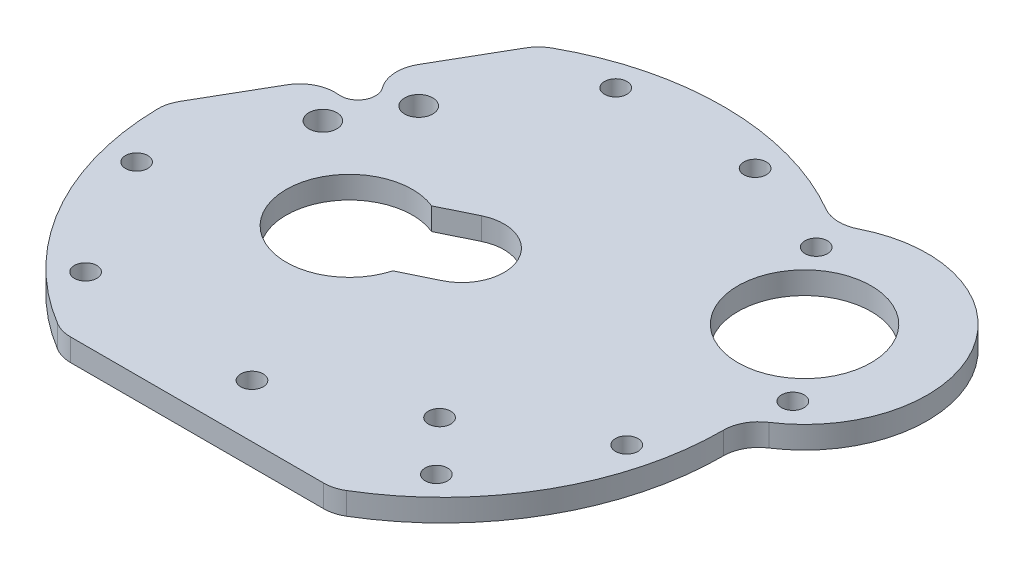
ISO-10303-21;
HEADER;
FILE_DESCRIPTION(('STEP AP214'),'2;1');
FILE_NAME('part.step','',(''),(''),'','','');
FILE_SCHEMA(('AUTOMOTIVE_DESIGN { 1 0 10303 214 1 1 1 1 }'));
ENDSEC;
DATA;
#1=APPLICATION_CONTEXT('core data for automotive mechanical design processes');
#2=APPLICATION_PROTOCOL_DEFINITION('international standard','automotive_design',2000,#1);
#3=PRODUCT_CONTEXT('',#1,'mechanical');
#4=PRODUCT('Part','Part','',(#3));
#5=PRODUCT_RELATED_PRODUCT_CATEGORY('part','',(#4));
#6=PRODUCT_DEFINITION_FORMATION('','',#4);
#7=PRODUCT_DEFINITION_CONTEXT('part definition',#1,'design');
#8=PRODUCT_DEFINITION('design','',#6,#7);
#9=PRODUCT_DEFINITION_SHAPE('','',#8);
#10=(LENGTH_UNIT() NAMED_UNIT(*) SI_UNIT(.MILLI.,.METRE.));
#11=(NAMED_UNIT(*) PLANE_ANGLE_UNIT() SI_UNIT($,.RADIAN.));
#12=(NAMED_UNIT(*) SI_UNIT($,.STERADIAN.) SOLID_ANGLE_UNIT());
#13=UNCERTAINTY_MEASURE_WITH_UNIT(LENGTH_MEASURE(1.E-05),#10,'distance_accuracy_value','');
#14=(GEOMETRIC_REPRESENTATION_CONTEXT(3) GLOBAL_UNCERTAINTY_ASSIGNED_CONTEXT((#13)) GLOBAL_UNIT_ASSIGNED_CONTEXT((#10,
#11,#12)) REPRESENTATION_CONTEXT('',''));
#15=CARTESIAN_POINT('',(0.,0.,0.));
#16=DIRECTION('',(0.,0.,1.));
#17=DIRECTION('',(1.,0.,0.));
#18=AXIS2_PLACEMENT_3D('',#15,#16,#17);
#19=CARTESIAN_POINT('',(-30.3108891324554,3.175,-17.5));
#20=DIRECTION('',(0.866025403784439,0.,0.5));
#21=DIRECTION('',(0.5,0.,-0.866025403784439));
#22=AXIS2_PLACEMENT_3D('',#19,#20,#21);
#23=PLANE('',#22);
#24=DIRECTION('',(-0.5,0.,0.866025403784439));
#25=VECTOR('',#24,1.);
#26=CARTESIAN_POINT('',(-30.3108891324554,3.175,-17.5));
#27=LINE('',#26,#25);
#28=CARTESIAN_POINT('',(-21.2970109437954,3.175,-33.112494995996));
#29=VERTEX_POINT('',#28);
#30=CARTESIAN_POINT('',(-26.8739573612385,3.175,-23.4529404498953));
#31=VERTEX_POINT('',#30);
#32=EDGE_CURVE('E222',#29,#31,#27,.T.);
#33=ORIENTED_EDGE('',*,*,#32,.F.);
#34=DIRECTION('',(0.,-1.,0.));
#35=VECTOR('',#34,1.);
#36=CARTESIAN_POINT('',(-21.2970109437954,3.175,-33.112494995996));
#37=LINE('',#36,#35);
#38=CARTESIAN_POINT('',(-21.2970109437954,0.,-33.112494995996));
#39=VERTEX_POINT('',#38);
#40=EDGE_CURVE('E371',#29,#39,#37,.T.);
#41=ORIENTED_EDGE('',*,*,#40,.T.);
#42=DIRECTION('',(-0.5,0.,0.866025403784439));
#43=VECTOR('',#42,1.);
#44=CARTESIAN_POINT('',(-30.3108891324554,0.,-17.5));
#45=LINE('',#44,#43);
#46=CARTESIAN_POINT('',(-26.8739573612385,0.,-23.4529404498953));
#47=VERTEX_POINT('',#46);
#48=EDGE_CURVE('E291',#39,#47,#45,.T.);
#49=ORIENTED_EDGE('',*,*,#48,.T.);
#50=DIRECTION('',(0.,1.,0.));
#51=VECTOR('',#50,1.);
#52=CARTESIAN_POINT('',(-26.8739573612385,3.175,-23.4529404498953));
#53=LINE('',#52,#51);
#54=EDGE_CURVE('E52',#47,#31,#53,.T.);
#55=ORIENTED_EDGE('',*,*,#54,.T.);
#56=EDGE_LOOP('',(#33,#41,#49,#55));
#57=FACE_BOUND('',#56,.T.);
#58=ADVANCED_FACE('F37',(#57),#23,.F.);
#59=CARTESIAN_POINT('',(32.7031788014801,3.175,-18.8811890843912));
#60=DIRECTION('',(0.,-1.,0.));
#61=DIRECTION('',(0.,0.,-1.));
#62=AXIS2_PLACEMENT_3D('',#59,#60,#61);
#63=CYLINDRICAL_SURFACE('',#62,17.5);
#64=CARTESIAN_POINT('',(32.7031788014801,0.,-18.8811890843912));
#65=DIRECTION('',(0.,1.,0.));
#66=DIRECTION('',(0.,0.,1.));
#67=AXIS2_PLACEMENT_3D('',#64,#65,#66);
#68=CIRCLE('',#67,17.5);
#69=CARTESIAN_POINT('',(42.267360109847,0.,-4.22593624110372));
#70=VERTEX_POINT('',#69);
#71=CARTESIAN_POINT('',(24.7934481944923,0.,-34.4916394854809));
#72=VERTEX_POINT('',#71);
#73=EDGE_CURVE('E282',#70,#72,#68,.T.);
#74=ORIENTED_EDGE('',*,*,#73,.T.);
#75=DIRECTION('',(0.,-1.,0.));
#76=VECTOR('',#75,1.);
#77=CARTESIAN_POINT('',(24.7934481944923,3.175,-34.4916394854809));
#78=LINE('',#77,#76);
#79=CARTESIAN_POINT('',(24.7934481944923,3.175,-34.4916394854809));
#80=VERTEX_POINT('',#79);
#81=EDGE_CURVE('E312',#72,#80,#78,.F.);
#82=ORIENTED_EDGE('',*,*,#81,.T.);
#83=CARTESIAN_POINT('',(32.7031788014801,3.175,-18.8811890843912));
#84=DIRECTION('',(0.,1.,0.));
#85=DIRECTION('',(0.,0.,1.));
#86=AXIS2_PLACEMENT_3D('',#83,#84,#85);
#87=CIRCLE('',#86,17.5);
#88=CARTESIAN_POINT('',(42.267360109847,3.175,-4.22593624110372));
#89=VERTEX_POINT('',#88);
#90=EDGE_CURVE('E215',#89,#80,#87,.T.);
#91=ORIENTED_EDGE('',*,*,#90,.F.);
#92=DIRECTION('',(0.,-1.,0.));
#93=VECTOR('',#92,1.);
#94=CARTESIAN_POINT('',(42.267360109847,3.175,-4.22593624110372));
#95=LINE('',#94,#93);
#96=EDGE_CURVE('E309',#89,#70,#95,.T.);
#97=ORIENTED_EDGE('',*,*,#96,.T.);
#98=EDGE_LOOP('',(#74,#82,#91,#97));
#99=FACE_BOUND('',#98,.T.);
#100=ADVANCED_FACE('F475',(#99),#63,.T.);
#101=CARTESIAN_POINT('',(0.,3.175,0.));
#102=DIRECTION('',(0.,-1.,0.));
#103=DIRECTION('',(0.,0.,-1.));
#104=AXIS2_PLACEMENT_3D('',#101,#102,#103);
#105=CYLINDRICAL_SURFACE('',#104,40.);
#106=CARTESIAN_POINT('',(0.,0.,0.));
#107=DIRECTION('',(0.,1.,0.));
#108=DIRECTION('',(0.,0.,1.));
#109=AXIS2_PLACEMENT_3D('',#106,#107,#108);
#110=CIRCLE('',#109,40.);
#111=CARTESIAN_POINT('',(20.0298001457105,0.,-34.623793930228));
#112=VERTEX_POINT('',#111);
#113=CARTESIAN_POINT('',(-19.3907244855694,0.,-34.9857085668525));
#114=VERTEX_POINT('',#113);
#115=EDGE_CURVE('E285',#112,#114,#110,.T.);
#116=ORIENTED_EDGE('',*,*,#115,.T.);
#117=DIRECTION('',(0.,-1.,0.));
#118=VECTOR('',#117,1.);
#119=CARTESIAN_POINT('',(-19.3907244855694,3.175,-34.9857085668525));
#120=LINE('',#119,#118);
#121=CARTESIAN_POINT('',(-19.3907244855694,3.175,-34.9857085668525));
#122=VERTEX_POINT('',#121);
#123=EDGE_CURVE('E374',#114,#122,#120,.F.);
#124=ORIENTED_EDGE('',*,*,#123,.T.);
#125=CARTESIAN_POINT('',(0.,3.175,0.));
#126=DIRECTION('',(0.,1.,0.));
#127=DIRECTION('',(0.,0.,1.));
#128=AXIS2_PLACEMENT_3D('',#125,#126,#127);
#129=CIRCLE('',#128,40.);
#130=CARTESIAN_POINT('',(20.0298001457105,3.175,-34.623793930228));
#131=VERTEX_POINT('',#130);
#132=EDGE_CURVE('E219',#131,#122,#129,.T.);
#133=ORIENTED_EDGE('',*,*,#132,.F.);
#134=DIRECTION('',(0.,-1.,0.));
#135=VECTOR('',#134,1.);
#136=CARTESIAN_POINT('',(20.0298001457105,3.175,-34.623793930228));
#137=LINE('',#136,#135);
#138=EDGE_CURVE('E187',#131,#112,#137,.T.);
#139=ORIENTED_EDGE('',*,*,#138,.T.);
#140=EDGE_LOOP('',(#116,#124,#133,#139));
#141=FACE_BOUND('',#140,.T.);
#142=ADVANCED_FACE('F481',(#141),#105,.T.);
#143=CARTESIAN_POINT('',(-33.7478209036722,0.,-11.5470595501047));
#144=VERTEX_POINT('',#143);
#145=CARTESIAN_POINT('',(-39.3247673211153,0.,-1.88750500400403));
#146=VERTEX_POINT('',#145);
#147=EDGE_CURVE('E288',#144,#146,#45,.T.);
#148=ORIENTED_EDGE('',*,*,#147,.T.);
#149=DIRECTION('',(0.,-1.,0.));
#150=VECTOR('',#149,1.);
#151=CARTESIAN_POINT('',(-39.3247673211153,3.175,-1.88750500400403));
#152=LINE('',#151,#150);
#153=CARTESIAN_POINT('',(-39.3247673211153,3.175,-1.88750500400403));
#154=VERTEX_POINT('',#153);
#155=EDGE_CURVE('E368',#146,#154,#152,.F.);
#156=ORIENTED_EDGE('',*,*,#155,.T.);
#157=CARTESIAN_POINT('',(-33.7478209036722,3.175,-11.5470595501047));
#158=VERTEX_POINT('',#157);
#159=EDGE_CURVE('E221',#158,#154,#27,.T.);
#160=ORIENTED_EDGE('',*,*,#159,.F.);
#161=DIRECTION('',(0.,1.,0.));
#162=VECTOR('',#161,1.);
#163=CARTESIAN_POINT('',(-33.7478209036722,3.175,-11.5470595501047));
#164=LINE('',#163,#162);
#165=EDGE_CURVE('E366',#158,#144,#164,.F.);
#166=ORIENTED_EDGE('',*,*,#165,.T.);
#167=EDGE_LOOP('',(#148,#156,#160,#166));
#168=FACE_BOUND('',#167,.T.);
#169=ADVANCED_FACE('F477',(#168),#23,.F.);
#170=CARTESIAN_POINT('',(0.,3.175,0.));
#171=DIRECTION('',(0.,-1.,0.));
#172=DIRECTION('',(0.,0.,-1.));
#173=AXIS2_PLACEMENT_3D('',#170,#171,#172);
#174=CYLINDRICAL_SURFACE('',#173,40.);
#175=CARTESIAN_POINT('',(0.,0.,0.));
#176=DIRECTION('',(0.,1.,0.));
#177=DIRECTION('',(0.,0.,1.));
#178=AXIS2_PLACEMENT_3D('',#175,#176,#177);
#179=CIRCLE('',#178,40.);
#180=CARTESIAN_POINT('',(-39.9938746310779,0.,0.699994281138249));
#181=VERTEX_POINT('',#180);
#182=CARTESIAN_POINT('',(-20.6031501455085,0.,34.2857142857143));
#183=VERTEX_POINT('',#182);
#184=EDGE_CURVE('E292',#181,#183,#179,.T.);
#185=ORIENTED_EDGE('',*,*,#184,.T.);
#186=DIRECTION('',(0.,-1.,0.));
#187=VECTOR('',#186,1.);
#188=CARTESIAN_POINT('',(-20.6031501455085,3.175,34.2857142857143));
#189=LINE('',#188,#187);
#190=CARTESIAN_POINT('',(-20.6031501455085,3.175,34.2857142857143));
#191=VERTEX_POINT('',#190);
#192=EDGE_CURVE('E364',#183,#191,#189,.F.);
#193=ORIENTED_EDGE('',*,*,#192,.T.);
#194=CARTESIAN_POINT('',(0.,3.175,0.));
#195=DIRECTION('',(0.,1.,0.));
#196=DIRECTION('',(0.,0.,1.));
#197=AXIS2_PLACEMENT_3D('',#194,#195,#196);
#198=CIRCLE('',#197,40.);
#199=CARTESIAN_POINT('',(-39.9938746310779,3.175,0.699994281138249));
#200=VERTEX_POINT('',#199);
#201=EDGE_CURVE('E224',#200,#191,#198,.T.);
#202=ORIENTED_EDGE('',*,*,#201,.F.);
#203=DIRECTION('',(0.,-1.,0.));
#204=VECTOR('',#203,1.);
#205=CARTESIAN_POINT('',(-39.9938746310778,3.175,0.699994281138249));
#206=LINE('',#205,#204);
#207=EDGE_CURVE('E361',#200,#181,#206,.T.);
#208=ORIENTED_EDGE('',*,*,#207,.T.);
#209=EDGE_LOOP('',(#185,#193,#202,#208));
#210=FACE_BOUND('',#209,.T.);
#211=ADVANCED_FACE('F487',(#210),#174,.T.);
#212=CARTESIAN_POINT('',(0.,3.175,35.));
#213=DIRECTION('',(0.,0.,-1.));
#214=DIRECTION('',(-1.,0.,0.));
#215=AXIS2_PLACEMENT_3D('',#212,#213,#214);
#216=PLANE('',#215);
#217=DIRECTION('',(1.,0.,0.));
#218=VECTOR('',#217,1.);
#219=CARTESIAN_POINT('',(0.,0.,35.));
#220=LINE('',#219,#218);
#221=CARTESIAN_POINT('',(-18.0277563773199,0.,35.));
#222=VERTEX_POINT('',#221);
#223=CARTESIAN_POINT('',(18.0277563773199,0.,35.));
#224=VERTEX_POINT('',#223);
#225=EDGE_CURVE('E295',#222,#224,#220,.T.);
#226=ORIENTED_EDGE('',*,*,#225,.T.);
#227=DIRECTION('',(0.,-1.,0.));
#228=VECTOR('',#227,1.);
#229=CARTESIAN_POINT('',(18.0277563773199,3.175,35.));
#230=LINE('',#229,#228);
#231=CARTESIAN_POINT('',(18.0277563773199,3.175,35.));
#232=VERTEX_POINT('',#231);
#233=EDGE_CURVE('E348',#224,#232,#230,.F.);
#234=ORIENTED_EDGE('',*,*,#233,.T.);
#235=DIRECTION('',(1.,0.,0.));
#236=VECTOR('',#235,1.);
#237=CARTESIAN_POINT('',(0.,3.175,35.));
#238=LINE('',#237,#236);
#239=CARTESIAN_POINT('',(-18.0277563773199,3.175,35.));
#240=VERTEX_POINT('',#239);
#241=EDGE_CURVE('E227',#240,#232,#238,.T.);
#242=ORIENTED_EDGE('',*,*,#241,.F.);
#243=DIRECTION('',(0.,-1.,0.));
#244=VECTOR('',#243,1.);
#245=CARTESIAN_POINT('',(-18.0277563773199,3.175,35.));
#246=LINE('',#245,#244);
#247=EDGE_CURVE('E345',#240,#222,#246,.T.);
#248=ORIENTED_EDGE('',*,*,#247,.T.);
#249=EDGE_LOOP('',(#226,#234,#242,#248));
#250=FACE_BOUND('',#249,.T.);
#251=ADVANCED_FACE('F493',(#250),#216,.F.);
#252=CARTESIAN_POINT('',(-1.1036926971255,3.175,-3.84471877129028));
#253=DIRECTION('',(0.,-1.,0.));
#254=DIRECTION('',(0.,0.,-1.));
#255=AXIS2_PLACEMENT_3D('',#252,#253,#254);
#256=CYLINDRICAL_SURFACE('',#255,5.99999999999999);
#257=CARTESIAN_POINT('',(-1.1036926971255,0.,-3.84471877129028));
#258=DIRECTION('',(0.,1.,0.));
#259=DIRECTION('',(0.,0.,1.));
#260=AXIS2_PLACEMENT_3D('',#257,#258,#259);
#261=CIRCLE('',#260,5.99999999999999);
#262=CARTESIAN_POINT('',(1.52653418360897,0.,1.54804550650471));
#263=VERTEX_POINT('',#262);
#264=CARTESIAN_POINT('',(-3.73391957785997,0.,-9.23748304908527));
#265=VERTEX_POINT('',#264);
#266=EDGE_CURVE('E183',#263,#265,#261,.T.);
#267=ORIENTED_EDGE('',*,*,#266,.F.);
#268=DIRECTION('',(0.,-1.,0.));
#269=VECTOR('',#268,1.);
#270=CARTESIAN_POINT('',(1.52653418360897,3.175,1.54804550650471));
#271=LINE('',#270,#269);
#272=CARTESIAN_POINT('',(1.52653418360897,3.175,1.54804550650471));
#273=VERTEX_POINT('',#272);
#274=EDGE_CURVE('E176',#273,#263,#271,.T.);
#275=ORIENTED_EDGE('',*,*,#274,.F.);
#276=CARTESIAN_POINT('',(-1.1036926971255,3.175,-3.84471877129028));
#277=DIRECTION('',(0.,1.,0.));
#278=DIRECTION('',(0.,0.,1.));
#279=AXIS2_PLACEMENT_3D('',#276,#277,#278);
#280=CIRCLE('',#279,5.99999999999999);
#281=CARTESIAN_POINT('',(-3.73391957785997,3.175,-9.23748304908527));
#282=VERTEX_POINT('',#281);
#283=EDGE_CURVE('E180',#273,#282,#280,.T.);
#284=ORIENTED_EDGE('',*,*,#283,.T.);
#285=DIRECTION('',(0.,-1.,0.));
#286=VECTOR('',#285,1.);
#287=CARTESIAN_POINT('',(-3.73391957785997,3.175,-9.23748304908527));
#288=LINE('',#287,#286);
#289=EDGE_CURVE('E232',#282,#265,#288,.T.);
#290=ORIENTED_EDGE('',*,*,#289,.T.);
#291=EDGE_LOOP('',(#267,#275,#284,#290));
#292=FACE_BOUND('',#291,.T.);
#293=ADVANCED_FACE('F178',(#292),#256,.F.);
#294=CARTESIAN_POINT('',(0.903291201095751,3.175,1.85202141967139));
#295=DIRECTION('',(0.438371146789079,0.,0.898794046299166));
#296=DIRECTION('',(0.898794046299166,0.,-0.438371146789079));
#297=AXIS2_PLACEMENT_3D('',#294,#295,#296);
#298=PLANE('',#297);
#299=DIRECTION('',(-0.898794046299166,0.,0.438371146789079));
#300=VECTOR('',#299,1.);
#301=CARTESIAN_POINT('',(0.903291201095751,0.,1.85202141967139));
#302=LINE('',#301,#300);
#303=CARTESIAN_POINT('',(-3.22970061608986,0.,3.86781621718886));
#304=VERTEX_POINT('',#303);
#305=EDGE_CURVE('E273',#263,#304,#302,.T.);
#306=ORIENTED_EDGE('',*,*,#305,.T.);
#307=DIRECTION('',(0.,-1.,0.));
#308=VECTOR('',#307,1.);
#309=CARTESIAN_POINT('',(-3.22970061608986,3.175,3.86781621718886));
#310=LINE('',#309,#308);
#311=CARTESIAN_POINT('',(-3.22970061608986,3.175,3.86781621718886));
#312=VERTEX_POINT('',#311);
#313=EDGE_CURVE('E188',#312,#304,#310,.T.);
#314=ORIENTED_EDGE('',*,*,#313,.F.);
#315=DIRECTION('',(-0.898794046299166,0.,0.438371146789079));
#316=VECTOR('',#315,1.);
#317=CARTESIAN_POINT('',(0.903291201095751,3.175,1.85202141967139));
#318=LINE('',#317,#316);
#319=EDGE_CURVE('E191',#273,#312,#318,.T.);
#320=ORIENTED_EDGE('',*,*,#319,.F.);
#321=ORIENTED_EDGE('',*,*,#274,.T.);
#322=EDGE_LOOP('',(#306,#314,#320,#321));
#323=FACE_BOUND('',#322,.T.);
#324=ADVANCED_FACE('F192',(#323),#298,.F.);
#325=CARTESIAN_POINT('',(-11.8892212527155,3.175,1.41573499017866));
#326=DIRECTION('',(0.,-1.,0.));
#327=DIRECTION('',(0.,0.,-1.));
#328=AXIS2_PLACEMENT_3D('',#325,#326,#327);
#329=CYLINDRICAL_SURFACE('',#328,9.00000000000007);
#330=CARTESIAN_POINT('',(-11.8892212527155,0.,1.41573499017866));
#331=DIRECTION('',(0.,1.,0.));
#332=DIRECTION('',(0.,0.,1.));
#333=AXIS2_PLACEMENT_3D('',#330,#331,#332);
#334=CIRCLE('',#333,9.00000000000007);
#335=CARTESIAN_POINT('',(-8.49015437755879,0.,-6.91771233840112));
#336=VERTEX_POINT('',#335);
#337=EDGE_CURVE('E276',#336,#304,#334,.T.);
#338=ORIENTED_EDGE('',*,*,#337,.F.);
#339=DIRECTION('',(0.,-1.,0.));
#340=VECTOR('',#339,1.);
#341=CARTESIAN_POINT('',(-8.49015437755879,3.175,-6.91771233840112));
#342=LINE('',#341,#340);
#343=CARTESIAN_POINT('',(-8.49015437755879,3.175,-6.91771233840112));
#344=VERTEX_POINT('',#343);
#345=EDGE_CURVE('E304',#344,#336,#342,.T.);
#346=ORIENTED_EDGE('',*,*,#345,.F.);
#347=CARTESIAN_POINT('',(-11.8892212527155,3.175,1.41573499017866));
#348=DIRECTION('',(0.,1.,0.));
#349=DIRECTION('',(0.,0.,1.));
#350=AXIS2_PLACEMENT_3D('',#347,#348,#349);
#351=CIRCLE('',#350,9.00000000000007);
#352=EDGE_CURVE('E196',#344,#312,#351,.T.);
#353=ORIENTED_EDGE('',*,*,#352,.T.);
#354=ORIENTED_EDGE('',*,*,#313,.T.);
#355=EDGE_LOOP('',(#338,#346,#353,#354));
#356=FACE_BOUND('',#355,.T.);
#357=ADVANCED_FACE('F465',(#356),#329,.F.);
#358=CARTESIAN_POINT('',(-4.35716256037318,3.175,-8.93350713591859));
#359=DIRECTION('',(0.438371146789078,0.,0.898794046299167));
#360=DIRECTION('',(0.898794046299167,0.,-0.438371146789078));
#361=AXIS2_PLACEMENT_3D('',#358,#359,#360);
#362=PLANE('',#361);
#363=DIRECTION('',(-0.898794046299167,0.,0.438371146789078));
#364=VECTOR('',#363,1.);
#365=CARTESIAN_POINT('',(-4.35716256037318,0.,-8.93350713591859));
#366=LINE('',#365,#364);
#367=EDGE_CURVE('E279',#265,#336,#366,.T.);
#368=ORIENTED_EDGE('',*,*,#367,.F.);
#369=ORIENTED_EDGE('',*,*,#289,.F.);
#370=DIRECTION('',(-0.898794046299167,0.,0.438371146789078));
#371=VECTOR('',#370,1.);
#372=CARTESIAN_POINT('',(-4.35716256037318,3.175,-8.93350713591859));
#373=LINE('',#372,#371);
#374=EDGE_CURVE('E200',#282,#344,#373,.T.);
#375=ORIENTED_EDGE('',*,*,#374,.T.);
#376=ORIENTED_EDGE('',*,*,#345,.T.);
#377=EDGE_LOOP('',(#368,#369,#375,#376));
#378=FACE_BOUND('',#377,.T.);
#379=ADVANCED_FACE('F452',(#378),#362,.T.);
#380=CARTESIAN_POINT('',(-34.9332342741632,3.175,8.69880124766783));
#381=DIRECTION('',(0.,-1.,0.));
#382=DIRECTION('',(0.,0.,-1.));
#383=AXIS2_PLACEMENT_3D('',#380,#381,#382);
#384=CYLINDRICAL_SURFACE('',#383,1.599999999409);
#385=CARTESIAN_POINT('',(-34.9332342741632,3.175,8.69880124766783));
#386=DIRECTION('',(0.,1.,0.));
#387=DIRECTION('',(0.,0.,1.));
#388=AXIS2_PLACEMENT_3D('',#385,#386,#387);
#389=CIRCLE('',#388,1.599999999409);
#390=CARTESIAN_POINT('',(-34.9332342741632,3.175,10.2988012470768));
#391=VERTEX_POINT('',#390);
#392=EDGE_CURVE('E202',#391,#391,#389,.T.);
#393=ORIENTED_EDGE('',*,*,#392,.T.);
#394=EDGE_LOOP('',(#393));
#395=FACE_BOUND('',#394,.T.);
#396=CARTESIAN_POINT('',(-34.9332342741632,0.,8.69880124766783));
#397=DIRECTION('',(0.,1.,0.));
#398=DIRECTION('',(0.,0.,1.));
#399=AXIS2_PLACEMENT_3D('',#396,#397,#398);
#400=CIRCLE('',#399,1.599999999409);
#401=CARTESIAN_POINT('',(-34.9332342741632,0.,10.2988012470768));
#402=VERTEX_POINT('',#401);
#403=EDGE_CURVE('E269',#402,#402,#400,.T.);
#404=ORIENTED_EDGE('',*,*,#403,.F.);
#405=EDGE_LOOP('',(#404));
#406=FACE_BOUND('',#405,.T.);
#407=ADVANCED_FACE('F449',(#395,#406),#384,.F.);
#408=CARTESIAN_POINT('',(25.0000000000337,3.175,25.9036676939446));
#409=DIRECTION('',(0.,-1.,0.));
#410=DIRECTION('',(0.,0.,-1.));
#411=AXIS2_PLACEMENT_3D('',#408,#409,#410);
#412=CYLINDRICAL_SURFACE('',#411,1.599999999409);
#413=CARTESIAN_POINT('',(25.0000000000337,3.175,25.9036676939446));
#414=DIRECTION('',(0.,1.,0.));
#415=DIRECTION('',(0.,0.,1.));
#416=AXIS2_PLACEMENT_3D('',#413,#414,#415);
#417=CIRCLE('',#416,1.599999999409);
#418=CARTESIAN_POINT('',(25.0000000000337,3.175,27.5036676933536));
#419=VERTEX_POINT('',#418);
#420=EDGE_CURVE('E208',#419,#419,#417,.T.);
#421=ORIENTED_EDGE('',*,*,#420,.T.);
#422=EDGE_LOOP('',(#421));
#423=FACE_BOUND('',#422,.T.);
#424=CARTESIAN_POINT('',(25.0000000000337,0.,25.9036676939446));
#425=DIRECTION('',(0.,1.,0.));
#426=DIRECTION('',(0.,0.,1.));
#427=AXIS2_PLACEMENT_3D('',#424,#425,#426);
#428=CIRCLE('',#427,1.599999999409);
#429=CARTESIAN_POINT('',(25.0000000000337,0.,27.5036676933536));
#430=VERTEX_POINT('',#429);
#431=EDGE_CURVE('E266',#430,#430,#428,.T.);
#432=ORIENTED_EDGE('',*,*,#431,.F.);
#433=EDGE_LOOP('',(#432));
#434=FACE_BOUND('',#433,.T.);
#435=ADVANCED_FACE('F440',(#423,#434),#412,.F.);
#436=CARTESIAN_POINT('',(0.24263363698146,3.175,27.4303096923593));
#437=DIRECTION('',(0.,-1.,0.));
#438=DIRECTION('',(0.,0.,-1.));
#439=AXIS2_PLACEMENT_3D('',#436,#437,#438);
#440=CYLINDRICAL_SURFACE('',#439,1.599999999409);
#441=CARTESIAN_POINT('',(0.24263363698146,3.175,27.4303096923593));
#442=DIRECTION('',(0.,1.,0.));
#443=DIRECTION('',(0.,0.,1.));
#444=AXIS2_PLACEMENT_3D('',#441,#442,#443);
#445=CIRCLE('',#444,1.599999999409);
#446=CARTESIAN_POINT('',(0.24263363698146,3.175,29.0303096917683));
#447=VERTEX_POINT('',#446);
#448=EDGE_CURVE('E434',#447,#447,#445,.T.);
#449=ORIENTED_EDGE('',*,*,#448,.T.);
#450=EDGE_LOOP('',(#449));
#451=FACE_BOUND('',#450,.T.);
#452=CARTESIAN_POINT('',(0.24263363698146,0.,27.4303096923593));
#453=DIRECTION('',(0.,1.,0.));
#454=DIRECTION('',(0.,0.,1.));
#455=AXIS2_PLACEMENT_3D('',#452,#453,#454);
#456=CIRCLE('',#455,1.599999999409);
#457=CARTESIAN_POINT('',(0.24263363698146,0.,29.0303096917683));
#458=VERTEX_POINT('',#457);
#459=EDGE_CURVE('E263',#458,#458,#456,.T.);
#460=ORIENTED_EDGE('',*,*,#459,.F.);
#461=EDGE_LOOP('',(#460));
#462=FACE_BOUND('',#461,.T.);
#463=ADVANCED_FACE('F592',(#451,#462),#440,.F.);
#464=CARTESIAN_POINT('',(-25.0000000000337,3.175,25.9036676939447));
#465=DIRECTION('',(0.,-1.,0.));
#466=DIRECTION('',(0.,0.,-1.));
#467=AXIS2_PLACEMENT_3D('',#464,#465,#466);
#468=CYLINDRICAL_SURFACE('',#467,1.599999999409);
#469=CARTESIAN_POINT('',(-25.0000000000337,3.175,25.9036676939447));
#470=DIRECTION('',(0.,1.,0.));
#471=DIRECTION('',(0.,0.,1.));
#472=AXIS2_PLACEMENT_3D('',#469,#470,#471);
#473=CIRCLE('',#472,1.599999999409);
#474=CARTESIAN_POINT('',(-25.0000000000337,3.175,27.5036676933537));
#475=VERTEX_POINT('',#474);
#476=EDGE_CURVE('E431',#475,#475,#473,.T.);
#477=ORIENTED_EDGE('',*,*,#476,.T.);
#478=EDGE_LOOP('',(#477));
#479=FACE_BOUND('',#478,.T.);
#480=CARTESIAN_POINT('',(-25.0000000000337,0.,25.9036676939447));
#481=DIRECTION('',(0.,1.,0.));
#482=DIRECTION('',(0.,0.,1.));
#483=AXIS2_PLACEMENT_3D('',#480,#481,#482);
#484=CIRCLE('',#483,1.599999999409);
#485=CARTESIAN_POINT('',(-25.0000000000337,0.,27.5036676933537));
#486=VERTEX_POINT('',#485);
#487=EDGE_CURVE('E260',#486,#486,#484,.T.);
#488=ORIENTED_EDGE('',*,*,#487,.F.);
#489=EDGE_LOOP('',(#488));
#490=FACE_BOUND('',#489,.T.);
#491=ADVANCED_FACE('F588',(#479,#490),#468,.F.);
#492=CARTESIAN_POINT('',(18.2185145629648,3.175,18.6628867565777));
#493=DIRECTION('',(0.,-1.,0.));
#494=DIRECTION('',(0.,0.,-1.));
#495=AXIS2_PLACEMENT_3D('',#492,#493,#494);
#496=CYLINDRICAL_SURFACE('',#495,1.599999999409);
#497=CARTESIAN_POINT('',(18.2185145629648,3.175,18.6628867565777));
#498=DIRECTION('',(0.,1.,0.));
#499=DIRECTION('',(0.,0.,1.));
#500=AXIS2_PLACEMENT_3D('',#497,#498,#499);
#501=CIRCLE('',#500,1.599999999409);
#502=CARTESIAN_POINT('',(18.2185145629648,3.175,20.2628867559867));
#503=VERTEX_POINT('',#502);
#504=EDGE_CURVE('E428',#503,#503,#501,.T.);
#505=ORIENTED_EDGE('',*,*,#504,.T.);
#506=EDGE_LOOP('',(#505));
#507=FACE_BOUND('',#506,.T.);
#508=CARTESIAN_POINT('',(18.2185145629648,0.,18.6628867565777));
#509=DIRECTION('',(0.,1.,0.));
#510=DIRECTION('',(0.,0.,1.));
#511=AXIS2_PLACEMENT_3D('',#508,#509,#510);
#512=CIRCLE('',#511,1.599999999409);
#513=CARTESIAN_POINT('',(18.2185145629648,0.,20.2628867559867));
#514=VERTEX_POINT('',#513);
#515=EDGE_CURVE('E256',#514,#514,#512,.T.);
#516=ORIENTED_EDGE('',*,*,#515,.F.);
#517=EDGE_LOOP('',(#516));
#518=FACE_BOUND('',#517,.T.);
#519=ADVANCED_FACE('F584',(#507,#518),#496,.F.);
#520=CARTESIAN_POINT('',(9.93323427412944,3.175,-34.6024689416125));
#521=DIRECTION('',(0.,-1.,0.));
#522=DIRECTION('',(0.,0.,-1.));
#523=AXIS2_PLACEMENT_3D('',#520,#521,#522);
#524=CYLINDRICAL_SURFACE('',#523,1.599999999409);
#525=CARTESIAN_POINT('',(9.93323427412944,3.175,-34.6024689416125));
#526=DIRECTION('',(0.,1.,0.));
#527=DIRECTION('',(0.,0.,1.));
#528=AXIS2_PLACEMENT_3D('',#525,#526,#527);
#529=CIRCLE('',#528,1.599999999409);
#530=CARTESIAN_POINT('',(9.93323427412944,3.175,-33.0024689422035));
#531=VERTEX_POINT('',#530);
#532=EDGE_CURVE('E425',#531,#531,#529,.T.);
#533=ORIENTED_EDGE('',*,*,#532,.T.);
#534=EDGE_LOOP('',(#533));
#535=FACE_BOUND('',#534,.T.);
#536=CARTESIAN_POINT('',(9.93323427412944,0.,-34.6024689416125));
#537=DIRECTION('',(0.,1.,0.));
#538=DIRECTION('',(0.,0.,1.));
#539=AXIS2_PLACEMENT_3D('',#536,#537,#538);
#540=CIRCLE('',#539,1.599999999409);
#541=CARTESIAN_POINT('',(9.93323427412944,0.,-33.0024689422035));
#542=VERTEX_POINT('',#541);
#543=EDGE_CURVE('E253',#542,#542,#540,.T.);
#544=ORIENTED_EDGE('',*,*,#543,.F.);
#545=EDGE_LOOP('',(#544));
#546=FACE_BOUND('',#545,.T.);
#547=ADVANCED_FACE('F580',(#535,#546),#524,.F.);
#548=CARTESIAN_POINT('',(41.3808115322484,3.175,-8.53958910228498));
#549=DIRECTION('',(0.,-1.,0.));
#550=DIRECTION('',(0.,0.,-1.));
#551=AXIS2_PLACEMENT_3D('',#548,#549,#550);
#552=CYLINDRICAL_SURFACE('',#551,1.599999999409);
#553=CARTESIAN_POINT('',(41.3808115322484,3.175,-8.53958910228498));
#554=DIRECTION('',(0.,1.,0.));
#555=DIRECTION('',(0.,0.,1.));
#556=AXIS2_PLACEMENT_3D('',#553,#554,#555);
#557=CIRCLE('',#556,1.599999999409);
#558=CARTESIAN_POINT('',(41.3808115322484,3.175,-6.93958910287598));
#559=VERTEX_POINT('',#558);
#560=EDGE_CURVE('E421',#559,#559,#557,.T.);
#561=ORIENTED_EDGE('',*,*,#560,.T.);
#562=EDGE_LOOP('',(#561));
#563=FACE_BOUND('',#562,.T.);
#564=CARTESIAN_POINT('',(41.3808115322484,0.,-8.53958910228498));
#565=DIRECTION('',(0.,1.,0.));
#566=DIRECTION('',(0.,0.,1.));
#567=AXIS2_PLACEMENT_3D('',#564,#565,#566);
#568=CIRCLE('',#567,1.599999999409);
#569=CARTESIAN_POINT('',(41.3808115322484,0.,-6.93958910287598));
#570=VERTEX_POINT('',#569);
#571=EDGE_CURVE('E249',#570,#570,#568,.T.);
#572=ORIENTED_EDGE('',*,*,#571,.F.);
#573=EDGE_LOOP('',(#572));
#574=FACE_BOUND('',#573,.T.);
#575=ADVANCED_FACE('F576',(#563,#574),#552,.F.);
#576=CARTESIAN_POINT('',(24.0255460707119,3.175,-29.2227890664975));
#577=DIRECTION('',(0.,-1.,0.));
#578=DIRECTION('',(0.,0.,-1.));
#579=AXIS2_PLACEMENT_3D('',#576,#577,#578);
#580=CYLINDRICAL_SURFACE('',#579,1.599999999409);
#581=CARTESIAN_POINT('',(24.0255460707119,3.175,-29.2227890664975));
#582=DIRECTION('',(0.,1.,0.));
#583=DIRECTION('',(0.,0.,1.));
#584=AXIS2_PLACEMENT_3D('',#581,#582,#583);
#585=CIRCLE('',#584,1.599999999409);
#586=CARTESIAN_POINT('',(24.0255460707119,3.175,-27.6227890670885));
#587=VERTEX_POINT('',#586);
#588=EDGE_CURVE('E417',#587,#587,#585,.T.);
#589=ORIENTED_EDGE('',*,*,#588,.T.);
#590=EDGE_LOOP('',(#589));
#591=FACE_BOUND('',#590,.T.);
#592=CARTESIAN_POINT('',(24.0255460707119,0.,-29.2227890664975));
#593=DIRECTION('',(0.,1.,0.));
#594=DIRECTION('',(0.,0.,1.));
#595=AXIS2_PLACEMENT_3D('',#592,#593,#594);
#596=CIRCLE('',#595,1.599999999409);
#597=CARTESIAN_POINT('',(24.0255460707119,0.,-27.6227890670885));
#598=VERTEX_POINT('',#597);
#599=EDGE_CURVE('E245',#598,#598,#596,.T.);
#600=ORIENTED_EDGE('',*,*,#599,.F.);
#601=EDGE_LOOP('',(#600));
#602=FACE_BOUND('',#601,.T.);
#603=ADVANCED_FACE('F572',(#591,#602),#580,.F.);
#604=CARTESIAN_POINT('',(34.9332342741632,3.175,8.69880124766781));
#605=DIRECTION('',(0.,-1.,0.));
#606=DIRECTION('',(0.,0.,-1.));
#607=AXIS2_PLACEMENT_3D('',#604,#605,#606);
#608=CYLINDRICAL_SURFACE('',#607,1.59999999940897);
#609=CARTESIAN_POINT('',(34.9332342741632,3.175,8.69880124766781));
#610=DIRECTION('',(0.,1.,0.));
#611=DIRECTION('',(0.,0.,1.));
#612=AXIS2_PLACEMENT_3D('',#609,#610,#611);
#613=CIRCLE('',#612,1.59999999940897);
#614=CARTESIAN_POINT('',(34.9332342741632,3.175,10.2988012470768));
#615=VERTEX_POINT('',#614);
#616=EDGE_CURVE('E414',#615,#615,#613,.T.);
#617=ORIENTED_EDGE('',*,*,#616,.T.);
#618=EDGE_LOOP('',(#617));
#619=FACE_BOUND('',#618,.T.);
#620=CARTESIAN_POINT('',(34.9332342741632,0.,8.69880124766781));
#621=DIRECTION('',(0.,1.,0.));
#622=DIRECTION('',(0.,0.,1.));
#623=AXIS2_PLACEMENT_3D('',#620,#621,#622);
#624=CIRCLE('',#623,1.59999999940897);
#625=CARTESIAN_POINT('',(34.9332342741632,0.,10.2988012470768));
#626=VERTEX_POINT('',#625);
#627=EDGE_CURVE('E241',#626,#626,#624,.T.);
#628=ORIENTED_EDGE('',*,*,#627,.F.);
#629=EDGE_LOOP('',(#628));
#630=FACE_BOUND('',#629,.T.);
#631=ADVANCED_FACE('F568',(#619,#630),#608,.F.);
#632=CARTESIAN_POINT('',(-9.93323427412952,3.175,-34.6024689416125));
#633=DIRECTION('',(0.,-1.,0.));
#634=DIRECTION('',(0.,0.,-1.));
#635=AXIS2_PLACEMENT_3D('',#632,#633,#634);
#636=CYLINDRICAL_SURFACE('',#635,1.599999999409);
#637=CARTESIAN_POINT('',(-9.93323427412952,3.175,-34.6024689416125));
#638=DIRECTION('',(0.,1.,0.));
#639=DIRECTION('',(0.,0.,1.));
#640=AXIS2_PLACEMENT_3D('',#637,#638,#639);
#641=CIRCLE('',#640,1.599999999409);
#642=CARTESIAN_POINT('',(-9.93323427412952,3.175,-33.0024689422035));
#643=VERTEX_POINT('',#642);
#644=EDGE_CURVE('E411',#643,#643,#641,.T.);
#645=ORIENTED_EDGE('',*,*,#644,.T.);
#646=EDGE_LOOP('',(#645));
#647=FACE_BOUND('',#646,.T.);
#648=CARTESIAN_POINT('',(-9.93323427412952,0.,-34.6024689416125));
#649=DIRECTION('',(0.,1.,0.));
#650=DIRECTION('',(0.,0.,1.));
#651=AXIS2_PLACEMENT_3D('',#648,#649,#650);
#652=CIRCLE('',#651,1.599999999409);
#653=CARTESIAN_POINT('',(-9.93323427412952,0.,-33.0024689422035));
#654=VERTEX_POINT('',#653);
#655=EDGE_CURVE('E237',#654,#654,#652,.T.);
#656=ORIENTED_EDGE('',*,*,#655,.F.);
#657=EDGE_LOOP('',(#656));
#658=FACE_BOUND('',#657,.T.);
#659=ADVANCED_FACE('F564',(#647,#658),#636,.F.);
#660=CARTESIAN_POINT('',(32.7031788014801,3.175,-18.8811890843912));
#661=DIRECTION('',(0.,-1.,0.));
#662=DIRECTION('',(0.,0.,-1.));
#663=AXIS2_PLACEMENT_3D('',#660,#661,#662);
#664=CYLINDRICAL_SURFACE('',#663,9.50000000000004);
#665=CARTESIAN_POINT('',(32.7031788014801,3.175,-18.8811890843912));
#666=DIRECTION('',(0.,1.,0.));
#667=DIRECTION('',(0.,0.,1.));
#668=AXIS2_PLACEMENT_3D('',#665,#666,#667);
#669=CIRCLE('',#668,9.50000000000004);
#670=CARTESIAN_POINT('',(32.7031788014801,3.175,-9.3811890843912));
#671=VERTEX_POINT('',#670);
#672=EDGE_CURVE('E301',#671,#671,#669,.T.);
#673=ORIENTED_EDGE('',*,*,#672,.T.);
#674=EDGE_LOOP('',(#673));
#675=FACE_BOUND('',#674,.T.);
#676=CARTESIAN_POINT('',(32.7031788014801,0.,-18.8811890843912));
#677=DIRECTION('',(0.,1.,0.));
#678=DIRECTION('',(0.,0.,1.));
#679=AXIS2_PLACEMENT_3D('',#676,#677,#678);
#680=CIRCLE('',#679,9.50000000000004);
#681=CARTESIAN_POINT('',(32.7031788014801,0.,-9.3811890843912));
#682=VERTEX_POINT('',#681);
#683=EDGE_CURVE('E233',#682,#682,#680,.T.);
#684=ORIENTED_EDGE('',*,*,#683,.F.);
#685=EDGE_LOOP('',(#684));
#686=FACE_BOUND('',#685,.T.);
#687=ADVANCED_FACE('F561',(#675,#686),#664,.F.);
#688=CARTESIAN_POINT('',(0.,3.175,0.));
#689=DIRECTION('',(0.,-1.,0.));
#690=DIRECTION('',(0.,0.,-1.));
#691=AXIS2_PLACEMENT_3D('',#688,#689,#690);
#692=CYLINDRICAL_SURFACE('',#691,40.);
#693=CARTESIAN_POINT('',(0.,3.175,0.));
#694=DIRECTION('',(0.,1.,0.));
#695=DIRECTION('',(0.,0.,1.));
#696=AXIS2_PLACEMENT_3D('',#693,#694,#695);
#697=CIRCLE('',#696,40.);
#698=CARTESIAN_POINT('',(20.6031501455085,3.175,34.2857142857143));
#699=VERTEX_POINT('',#698);
#700=CARTESIAN_POINT('',(39.9999851918302,3.175,-0.0344187937969504));
#701=VERTEX_POINT('',#700);
#702=EDGE_CURVE('E230',#699,#701,#697,.T.);
#703=ORIENTED_EDGE('',*,*,#702,.F.);
#704=DIRECTION('',(0.,-1.,0.));
#705=VECTOR('',#704,1.);
#706=CARTESIAN_POINT('',(20.6031501455085,3.175,34.2857142857143));
#707=LINE('',#706,#705);
#708=CARTESIAN_POINT('',(20.6031501455085,0.,34.2857142857143));
#709=VERTEX_POINT('',#708);
#710=EDGE_CURVE('E330',#699,#709,#707,.T.);
#711=ORIENTED_EDGE('',*,*,#710,.T.);
#712=CARTESIAN_POINT('',(0.,0.,0.));
#713=DIRECTION('',(0.,1.,0.));
#714=DIRECTION('',(0.,0.,1.));
#715=AXIS2_PLACEMENT_3D('',#712,#713,#714);
#716=CIRCLE('',#715,40.);
#717=CARTESIAN_POINT('',(39.9999851918302,0.,-0.0344187937969504));
#718=VERTEX_POINT('',#717);
#719=EDGE_CURVE('E299',#709,#718,#716,.T.);
#720=ORIENTED_EDGE('',*,*,#719,.T.);
#721=DIRECTION('',(0.,-1.,0.));
#722=VECTOR('',#721,1.);
#723=CARTESIAN_POINT('',(39.9999851918302,3.175,-0.0344187937969504));
#724=LINE('',#723,#722);
#725=EDGE_CURVE('E315',#718,#701,#724,.F.);
#726=ORIENTED_EDGE('',*,*,#725,.T.);
#727=EDGE_LOOP('',(#703,#711,#720,#726));
#728=FACE_BOUND('',#727,.T.);
#729=ADVANCED_FACE('F445',(#728),#692,.T.);
#730=CARTESIAN_POINT('',(0.,3.175,0.));
#731=DIRECTION('',(0.,1.,0.));
#732=DIRECTION('',(0.,0.,1.));
#733=AXIS2_PLACEMENT_3D('',#730,#731,#732);
#734=PLANE('',#733);
#735=ORIENTED_EDGE('',*,*,#241,.T.);
#736=CARTESIAN_POINT('',(18.0277563773199,3.175,30.));
#737=DIRECTION('',(0.,1.,0.));
#738=DIRECTION('',(0.,0.,1.));
#739=AXIS2_PLACEMENT_3D('',#736,#737,#738);
#740=CIRCLE('',#739,5.);
#741=EDGE_CURVE('E359',#232,#699,#740,.T.);
#742=ORIENTED_EDGE('',*,*,#741,.T.);
#743=ORIENTED_EDGE('',*,*,#702,.T.);
#744=CARTESIAN_POINT('',(44.9999833408089,3.175,-0.0387211430215688));
#745=DIRECTION('',(0.,1.,0.));
#746=DIRECTION('',(0.,0.,1.));
#747=AXIS2_PLACEMENT_3D('',#744,#745,#746);
#748=CIRCLE('',#747,5.);
#749=EDGE_CURVE('E327',#701,#89,#748,.F.);
#750=ORIENTED_EDGE('',*,*,#749,.T.);
#751=ORIENTED_EDGE('',*,*,#90,.T.);
#752=CARTESIAN_POINT('',(22.5335251639243,3.175,-38.9517681715065));
#753=DIRECTION('',(0.,1.,0.));
#754=DIRECTION('',(0.,0.,1.));
#755=AXIS2_PLACEMENT_3D('',#752,#753,#754);
#756=CIRCLE('',#755,5.);
#757=EDGE_CURVE('E322',#80,#131,#756,.F.);
#758=ORIENTED_EDGE('',*,*,#757,.T.);
#759=ORIENTED_EDGE('',*,*,#132,.T.);
#760=CARTESIAN_POINT('',(-16.9668839248732,3.175,-30.612494995996));
#761=DIRECTION('',(0.,1.,0.));
#762=DIRECTION('',(0.,0.,1.));
#763=AXIS2_PLACEMENT_3D('',#760,#761,#762);
#764=CIRCLE('',#763,5.);
#765=EDGE_CURVE('E59',#122,#29,#764,.T.);
#766=ORIENTED_EDGE('',*,*,#765,.T.);
#767=ORIENTED_EDGE('',*,*,#32,.T.);
#768=CARTESIAN_POINT('',(-22.5438303423163,3.175,-20.9529404498953));
#769=DIRECTION('',(0.,1.,0.));
#770=DIRECTION('',(0.,0.,1.));
#771=AXIS2_PLACEMENT_3D('',#768,#769,#770);
#772=CIRCLE('',#771,5.);
#773=CARTESIAN_POINT('',(-26.5671689973631,3.175,-17.9843134832984));
#774=VERTEX_POINT('',#773);
#775=EDGE_CURVE('E350',#31,#774,#772,.T.);
#776=ORIENTED_EDGE('',*,*,#775,.T.);
#777=CARTESIAN_POINT('',(-28.5788383248865,3.175,-16.5));
#778=DIRECTION('',(0.,1.,0.));
#779=DIRECTION('',(0.,0.,1.));
#780=AXIS2_PLACEMENT_3D('',#777,#778,#779);
#781=CIRCLE('',#780,2.5);
#782=CARTESIAN_POINT('',(-28.858456844841,3.175,-14.0156865167016));
#783=VERTEX_POINT('',#782);
#784=EDGE_CURVE('E385',#783,#774,#781,.T.);
#785=ORIENTED_EDGE('',*,*,#784,.F.);
#786=CARTESIAN_POINT('',(-29.4176938847501,3.175,-9.04705955010467));
#787=DIRECTION('',(0.,1.,0.));
#788=DIRECTION('',(0.,0.,1.));
#789=AXIS2_PLACEMENT_3D('',#786,#787,#788);
#790=CIRCLE('',#789,5.);
#791=EDGE_CURVE('E352',#783,#158,#790,.T.);
#792=ORIENTED_EDGE('',*,*,#791,.T.);
#793=ORIENTED_EDGE('',*,*,#159,.T.);
#794=CARTESIAN_POINT('',(-34.9946403021931,3.175,0.612494995995968));
#795=DIRECTION('',(0.,1.,0.));
#796=DIRECTION('',(0.,0.,1.));
#797=AXIS2_PLACEMENT_3D('',#794,#795,#796);
#798=CIRCLE('',#797,5.);
#799=EDGE_CURVE('E355',#154,#200,#798,.T.);
#800=ORIENTED_EDGE('',*,*,#799,.T.);
#801=ORIENTED_EDGE('',*,*,#201,.T.);
#802=CARTESIAN_POINT('',(-18.0277563773199,3.175,30.));
#803=DIRECTION('',(0.,1.,0.));
#804=DIRECTION('',(0.,0.,1.));
#805=AXIS2_PLACEMENT_3D('',#802,#803,#804);
#806=CIRCLE('',#805,5.);
#807=EDGE_CURVE('E357',#191,#240,#806,.T.);
#808=ORIENTED_EDGE('',*,*,#807,.T.);
#809=EDGE_LOOP('',(#735,#742,#743,#750,#751,#758,#759,#766,#767,#776,#785,#792,#793,#800,#801,#808));
#810=FACE_BOUND('',#809,.T.);
#811=CARTESIAN_POINT('',(-21.7487113059643,3.175,-18.3301270189222));
#812=DIRECTION('',(0.,1.,0.));
#813=DIRECTION('',(0.,0.,1.));
#814=AXIS2_PLACEMENT_3D('',#811,#812,#813);
#815=CIRCLE('',#814,2.00000000000001);
#816=CARTESIAN_POINT('',(-21.7487113059643,3.175,-16.3301270189222));
#817=VERTEX_POINT('',#816);
#818=EDGE_CURVE('E395',#817,#817,#815,.T.);
#819=ORIENTED_EDGE('',*,*,#818,.F.);
#820=EDGE_LOOP('',(#819));
#821=FACE_BOUND('',#820,.T.);
#822=CARTESIAN_POINT('',(-26.7487113059643,3.175,-9.6698729810778));
#823=DIRECTION('',(0.,1.,0.));
#824=DIRECTION('',(0.,0.,1.));
#825=AXIS2_PLACEMENT_3D('',#822,#823,#824);
#826=CIRCLE('',#825,2.);
#827=CARTESIAN_POINT('',(-26.7487113059643,3.175,-7.6698729810778));
#828=VERTEX_POINT('',#827);
#829=EDGE_CURVE('E403',#828,#828,#826,.T.);
#830=ORIENTED_EDGE('',*,*,#829,.F.);
#831=EDGE_LOOP('',(#830));
#832=FACE_BOUND('',#831,.T.);
#833=ORIENTED_EDGE('',*,*,#672,.F.);
#834=EDGE_LOOP('',(#833));
#835=FACE_BOUND('',#834,.T.);
#836=ORIENTED_EDGE('',*,*,#644,.F.);
#837=EDGE_LOOP('',(#836));
#838=FACE_BOUND('',#837,.T.);
#839=ORIENTED_EDGE('',*,*,#616,.F.);
#840=EDGE_LOOP('',(#839));
#841=FACE_BOUND('',#840,.T.);
#842=ORIENTED_EDGE('',*,*,#588,.F.);
#843=EDGE_LOOP('',(#842));
#844=FACE_BOUND('',#843,.T.);
#845=ORIENTED_EDGE('',*,*,#560,.F.);
#846=EDGE_LOOP('',(#845));
#847=FACE_BOUND('',#846,.T.);
#848=ORIENTED_EDGE('',*,*,#532,.F.);
#849=EDGE_LOOP('',(#848));
#850=FACE_BOUND('',#849,.T.);
#851=ORIENTED_EDGE('',*,*,#504,.F.);
#852=EDGE_LOOP('',(#851));
#853=FACE_BOUND('',#852,.T.);
#854=ORIENTED_EDGE('',*,*,#476,.F.);
#855=EDGE_LOOP('',(#854));
#856=FACE_BOUND('',#855,.T.);
#857=ORIENTED_EDGE('',*,*,#448,.F.);
#858=EDGE_LOOP('',(#857));
#859=FACE_BOUND('',#858,.T.);
#860=ORIENTED_EDGE('',*,*,#420,.F.);
#861=EDGE_LOOP('',(#860));
#862=FACE_BOUND('',#861,.T.);
#863=ORIENTED_EDGE('',*,*,#392,.F.);
#864=EDGE_LOOP('',(#863));
#865=FACE_BOUND('',#864,.T.);
#866=ORIENTED_EDGE('',*,*,#283,.F.);
#867=ORIENTED_EDGE('',*,*,#319,.T.);
#868=ORIENTED_EDGE('',*,*,#352,.F.);
#869=ORIENTED_EDGE('',*,*,#374,.F.);
#870=EDGE_LOOP('',(#866,#867,#868,#869));
#871=FACE_BOUND('',#870,.T.);
#872=ADVANCED_FACE('F198',(#810,#821,#832,#835,#838,#841,#844,#847,#850,#853,#856,#859,#862,
#865,#871),#734,.T.);
#873=CARTESIAN_POINT('',(0.,0.,0.));
#874=DIRECTION('',(0.,1.,0.));
#875=DIRECTION('',(0.,0.,1.));
#876=AXIS2_PLACEMENT_3D('',#873,#874,#875);
#877=PLANE('',#876);
#878=CARTESIAN_POINT('',(-21.7487113059643,0.,-18.3301270189222));
#879=DIRECTION('',(0.,1.,0.));
#880=DIRECTION('',(0.,0.,1.));
#881=AXIS2_PLACEMENT_3D('',#878,#879,#880);
#882=CIRCLE('',#881,2.00000000000001);
#883=CARTESIAN_POINT('',(-21.7487113059643,0.,-16.3301270189222));
#884=VERTEX_POINT('',#883);
#885=EDGE_CURVE('E400',#884,#884,#882,.F.);
#886=ORIENTED_EDGE('',*,*,#885,.F.);
#887=EDGE_LOOP('',(#886));
#888=FACE_BOUND('',#887,.T.);
#889=CARTESIAN_POINT('',(-26.7487113059643,0.,-9.6698729810778));
#890=DIRECTION('',(0.,1.,0.));
#891=DIRECTION('',(0.,0.,1.));
#892=AXIS2_PLACEMENT_3D('',#889,#890,#891);
#893=CIRCLE('',#892,2.);
#894=CARTESIAN_POINT('',(-26.7487113059643,0.,-7.6698729810778));
#895=VERTEX_POINT('',#894);
#896=EDGE_CURVE('E238',#895,#895,#893,.F.);
#897=ORIENTED_EDGE('',*,*,#896,.F.);
#898=EDGE_LOOP('',(#897));
#899=FACE_BOUND('',#898,.T.);
#900=ORIENTED_EDGE('',*,*,#683,.T.);
#901=EDGE_LOOP('',(#900));
#902=FACE_BOUND('',#901,.T.);
#903=ORIENTED_EDGE('',*,*,#655,.T.);
#904=EDGE_LOOP('',(#903));
#905=FACE_BOUND('',#904,.T.);
#906=ORIENTED_EDGE('',*,*,#627,.T.);
#907=EDGE_LOOP('',(#906));
#908=FACE_BOUND('',#907,.T.);
#909=ORIENTED_EDGE('',*,*,#599,.T.);
#910=EDGE_LOOP('',(#909));
#911=FACE_BOUND('',#910,.T.);
#912=ORIENTED_EDGE('',*,*,#571,.T.);
#913=EDGE_LOOP('',(#912));
#914=FACE_BOUND('',#913,.T.);
#915=ORIENTED_EDGE('',*,*,#543,.T.);
#916=EDGE_LOOP('',(#915));
#917=FACE_BOUND('',#916,.T.);
#918=ORIENTED_EDGE('',*,*,#515,.T.);
#919=EDGE_LOOP('',(#918));
#920=FACE_BOUND('',#919,.T.);
#921=ORIENTED_EDGE('',*,*,#487,.T.);
#922=EDGE_LOOP('',(#921));
#923=FACE_BOUND('',#922,.T.);
#924=ORIENTED_EDGE('',*,*,#459,.T.);
#925=EDGE_LOOP('',(#924));
#926=FACE_BOUND('',#925,.T.);
#927=ORIENTED_EDGE('',*,*,#431,.T.);
#928=EDGE_LOOP('',(#927));
#929=FACE_BOUND('',#928,.T.);
#930=ORIENTED_EDGE('',*,*,#403,.T.);
#931=EDGE_LOOP('',(#930));
#932=FACE_BOUND('',#931,.T.);
#933=ORIENTED_EDGE('',*,*,#266,.T.);
#934=ORIENTED_EDGE('',*,*,#367,.T.);
#935=ORIENTED_EDGE('',*,*,#337,.T.);
#936=ORIENTED_EDGE('',*,*,#305,.F.);
#937=EDGE_LOOP('',(#933,#934,#935,#936));
#938=FACE_BOUND('',#937,.T.);
#939=ORIENTED_EDGE('',*,*,#719,.F.);
#940=CARTESIAN_POINT('',(18.0277563773199,0.,30.));
#941=DIRECTION('',(0.,1.,0.));
#942=DIRECTION('',(0.,0.,1.));
#943=AXIS2_PLACEMENT_3D('',#940,#941,#942);
#944=CIRCLE('',#943,5.);
#945=EDGE_CURVE('E343',#709,#224,#944,.F.);
#946=ORIENTED_EDGE('',*,*,#945,.T.);
#947=ORIENTED_EDGE('',*,*,#225,.F.);
#948=CARTESIAN_POINT('',(-18.0277563773199,0.,30.));
#949=DIRECTION('',(0.,1.,0.));
#950=DIRECTION('',(0.,0.,1.));
#951=AXIS2_PLACEMENT_3D('',#948,#949,#950);
#952=CIRCLE('',#951,5.);
#953=EDGE_CURVE('E341',#222,#183,#952,.F.);
#954=ORIENTED_EDGE('',*,*,#953,.T.);
#955=ORIENTED_EDGE('',*,*,#184,.F.);
#956=CARTESIAN_POINT('',(-34.9946403021931,0.,0.612494995995968));
#957=DIRECTION('',(0.,1.,0.));
#958=DIRECTION('',(0.,0.,1.));
#959=AXIS2_PLACEMENT_3D('',#956,#957,#958);
#960=CIRCLE('',#959,5.);
#961=EDGE_CURVE('E339',#181,#146,#960,.F.);
#962=ORIENTED_EDGE('',*,*,#961,.T.);
#963=ORIENTED_EDGE('',*,*,#147,.F.);
#964=CARTESIAN_POINT('',(-29.4176938847501,0.,-9.04705955010467));
#965=DIRECTION('',(0.,1.,0.));
#966=DIRECTION('',(0.,0.,1.));
#967=AXIS2_PLACEMENT_3D('',#964,#965,#966);
#968=CIRCLE('',#967,5.);
#969=CARTESIAN_POINT('',(-28.858456844841,0.,-14.0156865167016));
#970=VERTEX_POINT('',#969);
#971=EDGE_CURVE('E335',#144,#970,#968,.F.);
#972=ORIENTED_EDGE('',*,*,#971,.T.);
#973=CARTESIAN_POINT('',(-28.5788383248865,0.,-16.5));
#974=DIRECTION('',(0.,1.,0.));
#975=DIRECTION('',(0.,0.,1.));
#976=AXIS2_PLACEMENT_3D('',#973,#974,#975);
#977=CIRCLE('',#976,2.5);
#978=CARTESIAN_POINT('',(-26.5671689973631,0.,-17.9843134832984));
#979=VERTEX_POINT('',#978);
#980=EDGE_CURVE('E382',#979,#970,#977,.F.);
#981=ORIENTED_EDGE('',*,*,#980,.F.);
#982=CARTESIAN_POINT('',(-22.5438303423163,0.,-20.9529404498953));
#983=DIRECTION('',(0.,1.,0.));
#984=DIRECTION('',(0.,0.,1.));
#985=AXIS2_PLACEMENT_3D('',#982,#983,#984);
#986=CIRCLE('',#985,5.);
#987=EDGE_CURVE('E333',#979,#47,#986,.F.);
#988=ORIENTED_EDGE('',*,*,#987,.T.);
#989=ORIENTED_EDGE('',*,*,#48,.F.);
#990=CARTESIAN_POINT('',(-16.9668839248732,0.,-30.612494995996));
#991=DIRECTION('',(0.,1.,0.));
#992=DIRECTION('',(0.,0.,1.));
#993=AXIS2_PLACEMENT_3D('',#990,#991,#992);
#994=CIRCLE('',#993,5.);
#995=EDGE_CURVE('E337',#39,#114,#994,.F.);
#996=ORIENTED_EDGE('',*,*,#995,.T.);
#997=ORIENTED_EDGE('',*,*,#115,.F.);
#998=CARTESIAN_POINT('',(22.5335251639243,0.,-38.9517681715065));
#999=DIRECTION('',(0.,1.,0.));
#1000=DIRECTION('',(0.,0.,1.));
#1001=AXIS2_PLACEMENT_3D('',#998,#999,#1000);
#1002=CIRCLE('',#1001,5.);
#1003=EDGE_CURVE('E319',#112,#72,#1002,.T.);
#1004=ORIENTED_EDGE('',*,*,#1003,.T.);
#1005=ORIENTED_EDGE('',*,*,#73,.F.);
#1006=CARTESIAN_POINT('',(44.9999833408089,0.,-0.0387211430215688));
#1007=DIRECTION('',(0.,1.,0.));
#1008=DIRECTION('',(0.,0.,1.));
#1009=AXIS2_PLACEMENT_3D('',#1006,#1007,#1008);
#1010=CIRCLE('',#1009,5.);
#1011=EDGE_CURVE('E324',#70,#718,#1010,.T.);
#1012=ORIENTED_EDGE('',*,*,#1011,.T.);
#1013=EDGE_LOOP('',(#939,#946,#947,#954,#955,#962,#963,#972,#981,#988,#989,#996,#997,#1004,
#1005,#1012));
#1014=FACE_BOUND('',#1013,.T.);
#1015=ADVANCED_FACE('F390',(#888,#899,#902,#905,#908,#911,#914,#917,#920,#923,#926,#929,#932,
#938,#1014),#877,.F.);
#1016=CARTESIAN_POINT('',(22.5335251639243,3.175,-38.9517681715065));
#1017=DIRECTION('',(0.,1.,0.));
#1018=DIRECTION('',(0.,0.,1.));
#1019=AXIS2_PLACEMENT_3D('',#1016,#1017,#1018);
#1020=CYLINDRICAL_SURFACE('',#1019,5.);
#1021=ORIENTED_EDGE('',*,*,#757,.F.);
#1022=ORIENTED_EDGE('',*,*,#81,.F.);
#1023=ORIENTED_EDGE('',*,*,#1003,.F.);
#1024=ORIENTED_EDGE('',*,*,#138,.F.);
#1025=EDGE_LOOP('',(#1021,#1022,#1023,#1024));
#1026=FACE_BOUND('',#1025,.T.);
#1027=ADVANCED_FACE('F458',(#1026),#1020,.F.);
#1028=CARTESIAN_POINT('',(44.9999833408089,3.175,-0.0387211430215688));
#1029=DIRECTION('',(0.,1.,0.));
#1030=DIRECTION('',(0.,0.,1.));
#1031=AXIS2_PLACEMENT_3D('',#1028,#1029,#1030);
#1032=CYLINDRICAL_SURFACE('',#1031,5.);
#1033=ORIENTED_EDGE('',*,*,#749,.F.);
#1034=ORIENTED_EDGE('',*,*,#725,.F.);
#1035=ORIENTED_EDGE('',*,*,#1011,.F.);
#1036=ORIENTED_EDGE('',*,*,#96,.F.);
#1037=EDGE_LOOP('',(#1033,#1034,#1035,#1036));
#1038=FACE_BOUND('',#1037,.T.);
#1039=ADVANCED_FACE('F526',(#1038),#1032,.F.);
#1040=CARTESIAN_POINT('',(-26.7487113059643,-0.00100000000000013,-9.6698729810778));
#1041=DIRECTION('',(0.,1.,0.));
#1042=DIRECTION('',(0.,0.,1.));
#1043=AXIS2_PLACEMENT_3D('',#1040,#1041,#1042);
#1044=CYLINDRICAL_SURFACE('',#1043,2.);
#1045=ORIENTED_EDGE('',*,*,#829,.T.);
#1046=EDGE_LOOP('',(#1045));
#1047=FACE_BOUND('',#1046,.T.);
#1048=ORIENTED_EDGE('',*,*,#896,.T.);
#1049=EDGE_LOOP('',(#1048));
#1050=FACE_BOUND('',#1049,.T.);
#1051=ADVANCED_FACE('F558',(#1047,#1050),#1044,.F.);
#1052=CARTESIAN_POINT('',(-21.7487113059643,-0.00100000000000013,-18.3301270189222));
#1053=DIRECTION('',(0.,1.,0.));
#1054=DIRECTION('',(0.,0.,1.));
#1055=AXIS2_PLACEMENT_3D('',#1052,#1053,#1054);
#1056=CYLINDRICAL_SURFACE('',#1055,2.00000000000001);
#1057=ORIENTED_EDGE('',*,*,#818,.T.);
#1058=EDGE_LOOP('',(#1057));
#1059=FACE_BOUND('',#1058,.T.);
#1060=ORIENTED_EDGE('',*,*,#885,.T.);
#1061=EDGE_LOOP('',(#1060));
#1062=FACE_BOUND('',#1061,.T.);
#1063=ADVANCED_FACE('F611',(#1059,#1062),#1056,.F.);
#1064=CARTESIAN_POINT('',(-28.5788383248865,-0.00100000000000013,-16.5));
#1065=DIRECTION('',(0.,1.,0.));
#1066=DIRECTION('',(0.,0.,1.));
#1067=AXIS2_PLACEMENT_3D('',#1064,#1065,#1066);
#1068=CYLINDRICAL_SURFACE('',#1067,2.5);
#1069=ORIENTED_EDGE('',*,*,#980,.T.);
#1070=DIRECTION('',(0.,1.,0.));
#1071=VECTOR('',#1070,1.);
#1072=CARTESIAN_POINT('',(-28.858456844841,-0.00100000000000013,-14.0156865167016));
#1073=LINE('',#1072,#1071);
#1074=EDGE_CURVE('E11',#970,#783,#1073,.T.);
#1075=ORIENTED_EDGE('',*,*,#1074,.T.);
#1076=ORIENTED_EDGE('',*,*,#784,.T.);
#1077=DIRECTION('',(0.,1.,0.));
#1078=VECTOR('',#1077,1.);
#1079=CARTESIAN_POINT('',(-26.5671689973631,-0.00100000000000013,-17.9843134832984));
#1080=LINE('',#1079,#1078);
#1081=EDGE_CURVE('E45',#774,#979,#1080,.F.);
#1082=ORIENTED_EDGE('',*,*,#1081,.T.);
#1083=EDGE_LOOP('',(#1069,#1075,#1076,#1082));
#1084=FACE_BOUND('',#1083,.T.);
#1085=ADVANCED_FACE('F381',(#1084),#1068,.F.);
#1086=CARTESIAN_POINT('',(18.0277563773199,3.175,30.));
#1087=DIRECTION('',(0.,-1.,0.));
#1088=DIRECTION('',(0.,0.,-1.));
#1089=AXIS2_PLACEMENT_3D('',#1086,#1087,#1088);
#1090=CYLINDRICAL_SURFACE('',#1089,5.);
#1091=ORIENTED_EDGE('',*,*,#741,.F.);
#1092=ORIENTED_EDGE('',*,*,#233,.F.);
#1093=ORIENTED_EDGE('',*,*,#945,.F.);
#1094=ORIENTED_EDGE('',*,*,#710,.F.);
#1095=EDGE_LOOP('',(#1091,#1092,#1093,#1094));
#1096=FACE_BOUND('',#1095,.T.);
#1097=ADVANCED_FACE('F518',(#1096),#1090,.T.);
#1098=CARTESIAN_POINT('',(-18.0277563773199,3.175,30.));
#1099=DIRECTION('',(0.,-1.,0.));
#1100=DIRECTION('',(0.,0.,-1.));
#1101=AXIS2_PLACEMENT_3D('',#1098,#1099,#1100);
#1102=CYLINDRICAL_SURFACE('',#1101,5.);
#1103=ORIENTED_EDGE('',*,*,#807,.F.);
#1104=ORIENTED_EDGE('',*,*,#192,.F.);
#1105=ORIENTED_EDGE('',*,*,#953,.F.);
#1106=ORIENTED_EDGE('',*,*,#247,.F.);
#1107=EDGE_LOOP('',(#1103,#1104,#1105,#1106));
#1108=FACE_BOUND('',#1107,.T.);
#1109=ADVANCED_FACE('F510',(#1108),#1102,.T.);
#1110=CARTESIAN_POINT('',(-34.9946403021931,3.175,0.612494995995968));
#1111=DIRECTION('',(0.,-1.,0.));
#1112=DIRECTION('',(0.,0.,-1.));
#1113=AXIS2_PLACEMENT_3D('',#1110,#1111,#1112);
#1114=CYLINDRICAL_SURFACE('',#1113,5.);
#1115=ORIENTED_EDGE('',*,*,#799,.F.);
#1116=ORIENTED_EDGE('',*,*,#155,.F.);
#1117=ORIENTED_EDGE('',*,*,#961,.F.);
#1118=ORIENTED_EDGE('',*,*,#207,.F.);
#1119=EDGE_LOOP('',(#1115,#1116,#1117,#1118));
#1120=FACE_BOUND('',#1119,.T.);
#1121=ADVANCED_FACE('F502',(#1120),#1114,.T.);
#1122=CARTESIAN_POINT('',(-16.9668839248732,3.175,-30.612494995996));
#1123=DIRECTION('',(0.,-1.,0.));
#1124=DIRECTION('',(0.,0.,-1.));
#1125=AXIS2_PLACEMENT_3D('',#1122,#1123,#1124);
#1126=CYLINDRICAL_SURFACE('',#1125,5.);
#1127=ORIENTED_EDGE('',*,*,#765,.F.);
#1128=ORIENTED_EDGE('',*,*,#123,.F.);
#1129=ORIENTED_EDGE('',*,*,#995,.F.);
#1130=ORIENTED_EDGE('',*,*,#40,.F.);
#1131=EDGE_LOOP('',(#1127,#1128,#1129,#1130));
#1132=FACE_BOUND('',#1131,.T.);
#1133=ADVANCED_FACE('F537',(#1132),#1126,.T.);
#1134=CARTESIAN_POINT('',(-29.4176938847501,-0.00100000000000013,-9.04705955010467));
#1135=DIRECTION('',(0.,1.,0.));
#1136=DIRECTION('',(0.,0.,1.));
#1137=AXIS2_PLACEMENT_3D('',#1134,#1135,#1136);
#1138=CYLINDRICAL_SURFACE('',#1137,5.);
#1139=ORIENTED_EDGE('',*,*,#971,.F.);
#1140=ORIENTED_EDGE('',*,*,#165,.F.);
#1141=ORIENTED_EDGE('',*,*,#791,.F.);
#1142=ORIENTED_EDGE('',*,*,#1074,.F.);
#1143=EDGE_LOOP('',(#1139,#1140,#1141,#1142));
#1144=FACE_BOUND('',#1143,.T.);
#1145=ADVANCED_FACE('F540',(#1144),#1138,.T.);
#1146=CARTESIAN_POINT('',(-22.5438303423163,-0.00100000000000013,-20.9529404498953));
#1147=DIRECTION('',(0.,1.,0.));
#1148=DIRECTION('',(0.,0.,1.));
#1149=AXIS2_PLACEMENT_3D('',#1146,#1147,#1148);
#1150=CYLINDRICAL_SURFACE('',#1149,5.);
#1151=ORIENTED_EDGE('',*,*,#775,.F.);
#1152=ORIENTED_EDGE('',*,*,#54,.F.);
#1153=ORIENTED_EDGE('',*,*,#987,.F.);
#1154=ORIENTED_EDGE('',*,*,#1081,.F.);
#1155=EDGE_LOOP('',(#1151,#1152,#1153,#1154));
#1156=FACE_BOUND('',#1155,.T.);
#1157=ADVANCED_FACE('F39',(#1156),#1150,.T.);
#1158=CLOSED_SHELL('',(#58,#100,#142,#169,#211,#251,#293,#324,#357,#379,#407,#435,#463,#491,
#519,#547,#575,#603,#631,#659,#687,#729,#872,#1015,#1027,#1039,#1051,#1063,#1085,#1097,#1109,
#1121,#1133,#1145,#1157));
#1159=MANIFOLD_SOLID_BREP('B2',#1158);
#1160=ADVANCED_BREP_SHAPE_REPRESENTATION('',(#18,#1159),#14);
#1161=SHAPE_DEFINITION_REPRESENTATION(#9,#1160);
ENDSEC;
END-ISO-10303-21;
